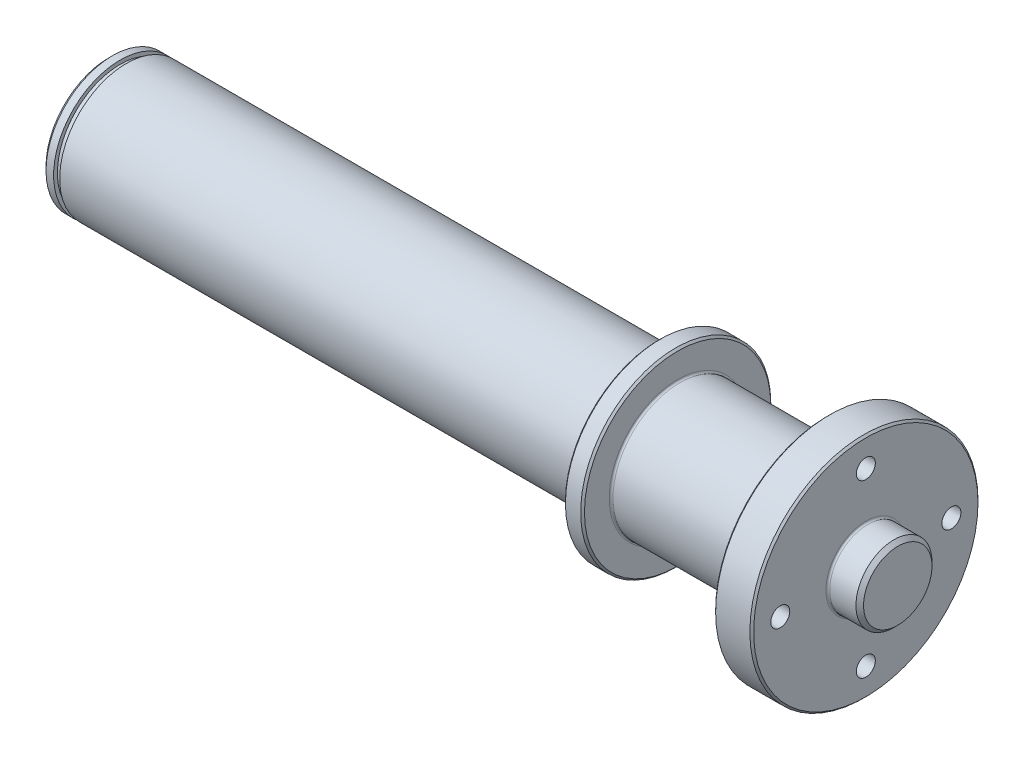
ISO-10303-21;
HEADER;
FILE_DESCRIPTION(('STEP AP214'),'2;1');
FILE_NAME('part.step','',(''),(''),'','','');
FILE_SCHEMA(('AUTOMOTIVE_DESIGN { 1 0 10303 214 1 1 1 1 }'));
ENDSEC;
DATA;
#1=APPLICATION_CONTEXT('core data for automotive mechanical design processes');
#2=APPLICATION_PROTOCOL_DEFINITION('international standard','automotive_design',2000,#1);
#3=PRODUCT_CONTEXT('',#1,'mechanical');
#4=PRODUCT('Part','Part','',(#3));
#5=PRODUCT_RELATED_PRODUCT_CATEGORY('part','',(#4));
#6=PRODUCT_DEFINITION_FORMATION('','',#4);
#7=PRODUCT_DEFINITION_CONTEXT('part definition',#1,'design');
#8=PRODUCT_DEFINITION('design','',#6,#7);
#9=PRODUCT_DEFINITION_SHAPE('','',#8);
#10=(LENGTH_UNIT() NAMED_UNIT(*) SI_UNIT(.MILLI.,.METRE.));
#11=(NAMED_UNIT(*) PLANE_ANGLE_UNIT() SI_UNIT($,.RADIAN.));
#12=(NAMED_UNIT(*) SI_UNIT($,.STERADIAN.) SOLID_ANGLE_UNIT());
#13=UNCERTAINTY_MEASURE_WITH_UNIT(LENGTH_MEASURE(1.E-05),#10,'distance_accuracy_value','');
#14=(GEOMETRIC_REPRESENTATION_CONTEXT(3) GLOBAL_UNCERTAINTY_ASSIGNED_CONTEXT((#13)) GLOBAL_UNIT_ASSIGNED_CONTEXT((#10,
#11,#12)) REPRESENTATION_CONTEXT('',''));
#15=CARTESIAN_POINT('',(0.,0.,0.));
#16=DIRECTION('',(0.,0.,1.));
#17=DIRECTION('',(1.,0.,0.));
#18=AXIS2_PLACEMENT_3D('',#15,#16,#17);
#19=CARTESIAN_POINT('',(0.,0.,0.));
#20=DIRECTION('',(-1.,0.,0.));
#21=DIRECTION('',(0.,0.,1.));
#22=AXIS2_PLACEMENT_3D('',#19,#20,#21);
#23=PLANE('',#22);
#24=CARTESIAN_POINT('',(0.,0.,0.));
#25=DIRECTION('',(-1.,0.,0.));
#26=DIRECTION('',(0.,0.,1.));
#27=AXIS2_PLACEMENT_3D('',#24,#25,#26);
#28=CIRCLE('',#27,16.5);
#29=CARTESIAN_POINT('',(0.,0.,16.5));
#30=VERTEX_POINT('',#29);
#31=EDGE_CURVE('E142',#30,#30,#28,.T.);
#32=ORIENTED_EDGE('',*,*,#31,.T.);
#33=EDGE_LOOP('',(#32));
#34=FACE_BOUND('',#33,.T.);
#35=ADVANCED_FACE('F34',(#34),#23,.T.);
#36=CARTESIAN_POINT('',(0.,0.,0.));
#37=DIRECTION('',(1.,0.,0.));
#38=DIRECTION('',(0.,0.,-1.));
#39=AXIS2_PLACEMENT_3D('',#36,#37,#38);
#40=CYLINDRICAL_SURFACE('',#39,17.5);
#41=CARTESIAN_POINT('',(0.99999999999998,0.,0.));
#42=DIRECTION('',(-1.,0.,0.));
#43=DIRECTION('',(0.,0.,1.));
#44=AXIS2_PLACEMENT_3D('',#41,#42,#43);
#45=CIRCLE('',#44,17.5);
#46=CARTESIAN_POINT('',(0.99999999999998,0.,17.5));
#47=VERTEX_POINT('',#46);
#48=EDGE_CURVE('E139',#47,#47,#45,.F.);
#49=ORIENTED_EDGE('',*,*,#48,.T.);
#50=EDGE_LOOP('',(#49));
#51=FACE_BOUND('',#50,.T.);
#52=CARTESIAN_POINT('',(3.,0.,0.));
#53=DIRECTION('',(1.,0.,0.));
#54=DIRECTION('',(0.,0.,-1.));
#55=AXIS2_PLACEMENT_3D('',#52,#53,#54);
#56=CIRCLE('',#55,17.5);
#57=CARTESIAN_POINT('',(3.,0.,-17.5));
#58=VERTEX_POINT('',#57);
#59=EDGE_CURVE('E136',#58,#58,#56,.T.);
#60=ORIENTED_EDGE('',*,*,#59,.F.);
#61=EDGE_LOOP('',(#60));
#62=FACE_BOUND('',#61,.T.);
#63=ADVANCED_FACE('F250',(#51,#62),#40,.T.);
#64=CARTESIAN_POINT('',(3.,17.5,0.));
#65=DIRECTION('',(1.,0.,0.));
#66=DIRECTION('',(0.,0.,-1.));
#67=AXIS2_PLACEMENT_3D('',#64,#65,#66);
#68=PLANE('',#67);
#69=ORIENTED_EDGE('',*,*,#59,.T.);
#70=EDGE_LOOP('',(#69));
#71=FACE_BOUND('',#70,.T.);
#72=CARTESIAN_POINT('',(3.,0.,0.));
#73=DIRECTION('',(1.,0.,0.));
#74=DIRECTION('',(0.,0.,-1.));
#75=AXIS2_PLACEMENT_3D('',#72,#73,#74);
#76=CIRCLE('',#75,16.5);
#77=CARTESIAN_POINT('',(3.,0.,-16.5));
#78=VERTEX_POINT('',#77);
#79=EDGE_CURVE('E133',#78,#78,#76,.T.);
#80=ORIENTED_EDGE('',*,*,#79,.F.);
#81=EDGE_LOOP('',(#80));
#82=FACE_BOUND('',#81,.T.);
#83=ADVANCED_FACE('F246',(#71,#82),#68,.T.);
#84=CARTESIAN_POINT('',(0.,0.,0.));
#85=DIRECTION('',(1.,0.,0.));
#86=DIRECTION('',(0.,0.,-1.));
#87=AXIS2_PLACEMENT_3D('',#84,#85,#86);
#88=CYLINDRICAL_SURFACE('',#87,16.5);
#89=ORIENTED_EDGE('',*,*,#79,.T.);
#90=EDGE_LOOP('',(#89));
#91=FACE_BOUND('',#90,.T.);
#92=CARTESIAN_POINT('',(4.6,0.,0.));
#93=DIRECTION('',(1.,0.,0.));
#94=DIRECTION('',(0.,0.,-1.));
#95=AXIS2_PLACEMENT_3D('',#92,#93,#94);
#96=CIRCLE('',#95,16.5);
#97=CARTESIAN_POINT('',(4.6,0.,-16.5));
#98=VERTEX_POINT('',#97);
#99=EDGE_CURVE('E130',#98,#98,#96,.T.);
#100=ORIENTED_EDGE('',*,*,#99,.F.);
#101=EDGE_LOOP('',(#100));
#102=FACE_BOUND('',#101,.T.);
#103=ADVANCED_FACE('F241',(#91,#102),#88,.T.);
#104=CARTESIAN_POINT('',(4.6,16.5,0.));
#105=DIRECTION('',(-1.,0.,0.));
#106=DIRECTION('',(0.,0.,1.));
#107=AXIS2_PLACEMENT_3D('',#104,#105,#106);
#108=PLANE('',#107);
#109=ORIENTED_EDGE('',*,*,#99,.T.);
#110=EDGE_LOOP('',(#109));
#111=FACE_BOUND('',#110,.T.);
#112=CARTESIAN_POINT('',(4.6,0.,0.));
#113=DIRECTION('',(1.,0.,0.));
#114=DIRECTION('',(0.,0.,-1.));
#115=AXIS2_PLACEMENT_3D('',#112,#113,#114);
#116=CIRCLE('',#115,17.5);
#117=CARTESIAN_POINT('',(4.6,0.,-17.5));
#118=VERTEX_POINT('',#117);
#119=EDGE_CURVE('E127',#118,#118,#116,.T.);
#120=ORIENTED_EDGE('',*,*,#119,.F.);
#121=EDGE_LOOP('',(#120));
#122=FACE_BOUND('',#121,.T.);
#123=ADVANCED_FACE('F235',(#111,#122),#108,.T.);
#124=CARTESIAN_POINT('',(0.,0.,0.));
#125=DIRECTION('',(1.,0.,0.));
#126=DIRECTION('',(0.,0.,-1.));
#127=AXIS2_PLACEMENT_3D('',#124,#125,#126);
#128=CYLINDRICAL_SURFACE('',#127,17.5);
#129=CARTESIAN_POINT('',(42.1,5.,-16.7705098312484));
#130=CARTESIAN_POINT('',(42.2375437669468,5.00001814544053,-16.7704912725158));
#131=CARTESIAN_POINT('',(42.3750806220229,4.99432529208164,-16.7722013219269));
#132=CARTESIAN_POINT('',(42.6491111892844,4.97165222541633,-16.7789431019967));
#133=CARTESIAN_POINT('',(42.7856051118428,4.95467435267922,-16.7839741438635));
#134=CARTESIAN_POINT('',(43.0562584540195,4.90961903685605,-16.7972068372471));
#135=CARTESIAN_POINT('',(43.1904226248333,4.88156789644729,-16.8054009743523));
#136=CARTESIAN_POINT('',(43.4557996419888,4.81461674604718,-16.8247046364186));
#137=CARTESIAN_POINT('',(43.587012422422,4.77571649404058,-16.8358142264156));
#138=CARTESIAN_POINT('',(43.8455316606223,4.68740449021953,-16.8606149796878));
#139=CARTESIAN_POINT('',(43.972840055364,4.63799805032664,-16.874304837985));
#140=CARTESIAN_POINT('',(44.2227993627257,4.52905522001708,-16.9038705765848));
#141=CARTESIAN_POINT('',(44.3454485233715,4.46951506432954,-16.9197472690052));
#142=CARTESIAN_POINT('',(44.705208360307,4.27631278448764,-16.9699997678901));
#143=CARTESIAN_POINT('',(44.9342983618955,4.12801150136261,-17.007014905076));
#144=CARTESIAN_POINT('',(45.3705139648694,3.7922991578269,-17.0850471293107));
#145=CARTESIAN_POINT('',(45.576920274657,3.60397767000143,-17.1261428352533));
#146=CARTESIAN_POINT('',(45.9557376930736,3.19544341696382,-17.2070462516998));
#147=CARTESIAN_POINT('',(46.128143164041,2.97522537348191,-17.2468537476932));
#148=CARTESIAN_POINT('',(46.4370780919675,2.5041085165938,-17.3215844019063));
#149=CARTESIAN_POINT('',(46.5728809242985,2.25271539483174,-17.3564029869975));
#150=CARTESIAN_POINT('',(46.8000077123923,1.72950937060037,-17.4163145657263));
#151=CARTESIAN_POINT('',(46.8913423051881,1.45770136944961,-17.4414098849257));
#152=CARTESIAN_POINT('',(47.0245857008507,0.908899275051303,-17.4784878135792));
#153=CARTESIAN_POINT('',(47.0677218545897,0.632225504452071,-17.4907954521753));
#154=CARTESIAN_POINT('',(47.1072166941546,0.0753060921048352,-17.5020523750682));
#155=CARTESIAN_POINT('',(47.1035833309957,-0.204938934421977,-17.5010039299558));
#156=CARTESIAN_POINT('',(47.0504845198055,-0.752451373530216,-17.4859002467781));
#157=CARTESIAN_POINT('',(47.0023476007258,-1.0198597093415,-17.4722220494947));
#158=CARTESIAN_POINT('',(46.8637591704515,-1.54263514692821,-17.433846479088));
#159=CARTESIAN_POINT('',(46.7733055229895,-1.79800164008105,-17.4091485496606));
#160=CARTESIAN_POINT('',(46.5517336287344,-2.29267928834747,-17.3509771517082));
#161=CARTESIAN_POINT('',(46.4201810479175,-2.53178407311227,-17.3174105731756));
#162=CARTESIAN_POINT('',(46.1203556664245,-2.98504901208546,-17.2450626129451));
#163=CARTESIAN_POINT('',(45.9520754127235,-3.19920408978386,-17.2062801734237));
#164=CARTESIAN_POINT('',(45.6723726411755,-3.50113424709605,-17.1465202223136));
#165=CARTESIAN_POINT('',(45.5726361356536,-3.6000742374355,-17.1259700648702));
#166=CARTESIAN_POINT('',(45.3651797576601,-3.78923134613091,-17.0851123940087));
#167=CARTESIAN_POINT('',(45.2574626601299,-3.87945147156873,-17.0648047990745));
#168=CARTESIAN_POINT('',(45.0346549590068,-4.05062437518906,-17.0249868857383));
#169=CARTESIAN_POINT('',(44.9195594701279,-4.13157091233147,-17.005477109874));
#170=CARTESIAN_POINT('',(44.682839206299,-4.28353981460234,-16.9678346429649));
#171=CARTESIAN_POINT('',(44.5612169966662,-4.35456603991597,-16.9497014175386));
#172=CARTESIAN_POINT('',(44.3110840486817,-4.48679157824972,-16.9151829895462));
#173=CARTESIAN_POINT('',(44.1825213722029,-4.54789718496759,-16.898814896638));
#174=CARTESIAN_POINT('',(43.92045850364,-4.65898872141544,-16.8685251216221));
#175=CARTESIAN_POINT('',(43.7869603422387,-4.70897916633161,-16.8546024466245));
#176=CARTESIAN_POINT('',(43.5160789886437,-4.79739484975373,-16.829649854127));
#177=CARTESIAN_POINT('',(43.3787000207409,-4.835832170633,-16.8186169160755));
#178=CARTESIAN_POINT('',(43.1010044543476,-4.90084834749728,-16.7997865631929));
#179=CARTESIAN_POINT('',(42.9606892484807,-4.92743269748004,-16.7919876494693));
#180=CARTESIAN_POINT('',(42.7003348857874,-4.96528740578586,-16.7808301521248));
#181=CARTESIAN_POINT('',(42.5805683702716,-4.97830600651657,-16.776966894118));
#182=CARTESIAN_POINT('',(42.3405377051843,-4.99566040544727,-16.7718034889731));
#183=CARTESIAN_POINT('',(42.220274596223,-5.0000094465416,-16.7704994326599));
#184=CARTESIAN_POINT('',(42.1,-4.99999999999999,-16.7705098312484));
#185=B_SPLINE_CURVE_WITH_KNOTS('',3,(#129,#130,#131,#132,#133,#134,#135,#136,#137,#138,#139,
#140,#141,#142,#143,#144,#145,#146,#147,#148,#149,#150,#151,#152,#153,#154,#155,#156,#157,#158,
#159,#160,#161,#162,#163,#164,#165,#166,#167,#168,#169,#170,#171,#172,#173,#174,#175,#176,#177,
#178,#179,#180,#181,#182,#183,#184),.UNSPECIFIED.,.F.,.F.,(4,2,2,2,2,2,2,2,2,2,2,2,2,2,2,2,2,2,
2,2,2,2,2,2,2,2,2,4),(0.,0.412492178804547,0.824898831357982,1.23633171981251,1.64777378699039,
2.05900832185038,2.47039598941262,3.29264569343991,4.13611232627188,4.9797186965021,
5.83900986868947,6.69809539287325,7.53476732988531,8.37129703101929,9.18363381655587,
9.99601161556283,10.8172828992968,11.6387209961027,12.0642579015972,12.489647531354,
12.9153217832843,13.3408299328975,13.7701489130554,14.1992931759112,14.6279870611799,
15.056482034464,15.4177510461265,15.7784677892952),.UNSPECIFIED.);
#186=CARTESIAN_POINT('',(42.1,5.,-16.7705098312484));
#187=VERTEX_POINT('',#186);
#188=CARTESIAN_POINT('',(42.1,-5.,-16.7705098312484));
#189=VERTEX_POINT('',#188);
#190=EDGE_CURVE('E199',#187,#189,#185,.T.);
#191=ORIENTED_EDGE('',*,*,#190,.F.);
#192=DIRECTION('',(1.,0.,0.));
#193=VECTOR('',#192,1.);
#194=CARTESIAN_POINT('',(0.,5.,-16.7705098312484));
#195=LINE('',#194,#193);
#196=CARTESIAN_POINT('',(12.1,5.,-16.7705098312484));
#197=VERTEX_POINT('',#196);
#198=EDGE_CURVE('E11',#197,#187,#195,.T.);
#199=ORIENTED_EDGE('',*,*,#198,.F.);
#200=CARTESIAN_POINT('',(12.1,-5.,-16.7705098312484));
#201=CARTESIAN_POINT('',(11.9624562330531,-5.00001814544053,-16.7704912725158));
#202=CARTESIAN_POINT('',(11.8249193779771,-4.99432529208164,-16.7722013219269));
#203=CARTESIAN_POINT('',(11.5508888107156,-4.97165222541634,-16.7789431019967));
#204=CARTESIAN_POINT('',(11.4143948881572,-4.95467435267923,-16.7839741438635));
#205=CARTESIAN_POINT('',(11.1437415459805,-4.90961903685605,-16.7972068372471));
#206=CARTESIAN_POINT('',(11.0095773751667,-4.88156789644729,-16.8054009743523));
#207=CARTESIAN_POINT('',(10.7442003580112,-4.81461674604718,-16.8247046364186));
#208=CARTESIAN_POINT('',(10.612987577578,-4.77571649404059,-16.8358142264156));
#209=CARTESIAN_POINT('',(10.3544683393777,-4.68740449021953,-16.8606149796878));
#210=CARTESIAN_POINT('',(10.227159944636,-4.63799805032664,-16.874304837985));
#211=CARTESIAN_POINT('',(9.97720063727428,-4.52905522001708,-16.9038705765848));
#212=CARTESIAN_POINT('',(9.85455147662851,-4.46951506432954,-16.9197472690052));
#213=CARTESIAN_POINT('',(9.49479163969302,-4.27631278448765,-16.9699997678901));
#214=CARTESIAN_POINT('',(9.26570163810453,-4.12801150136261,-17.007014905076));
#215=CARTESIAN_POINT('',(8.82948603513064,-3.79229915782691,-17.0850471293107));
#216=CARTESIAN_POINT('',(8.62307972534301,-3.60397767000144,-17.1261428352533));
#217=CARTESIAN_POINT('',(8.24426230692643,-3.19544341696382,-17.2070462516998));
#218=CARTESIAN_POINT('',(8.07185683595896,-2.97522537348192,-17.2468537476932));
#219=CARTESIAN_POINT('',(7.76292190803247,-2.5041085165938,-17.3215844019063));
#220=CARTESIAN_POINT('',(7.62711907570154,-2.25271539483174,-17.3564029869975));
#221=CARTESIAN_POINT('',(7.39999228760769,-1.72950937060037,-17.4163145657263));
#222=CARTESIAN_POINT('',(7.3086576948119,-1.45770136944961,-17.4414098849257));
#223=CARTESIAN_POINT('',(7.17541429914927,-0.908899275051308,-17.4784878135792));
#224=CARTESIAN_POINT('',(7.13227814541032,-0.632225504452075,-17.4907954521753));
#225=CARTESIAN_POINT('',(7.09278330584538,-0.0753060921048372,-17.5020523750682));
#226=CARTESIAN_POINT('',(7.09641666900433,0.204938934421976,-17.5010039299558));
#227=CARTESIAN_POINT('',(7.14951548019445,0.752451373530216,-17.4859002467781));
#228=CARTESIAN_POINT('',(7.19765239927417,1.0198597093415,-17.4722220494947));
#229=CARTESIAN_POINT('',(7.33624082954846,1.54263514692821,-17.433846479088));
#230=CARTESIAN_POINT('',(7.42669447701044,1.79800164008106,-17.4091485496606));
#231=CARTESIAN_POINT('',(7.64826637126563,2.29267928834747,-17.3509771517082));
#232=CARTESIAN_POINT('',(7.7798189520825,2.53178407311227,-17.3174105731756));
#233=CARTESIAN_POINT('',(8.07964433357547,2.98504901208546,-17.2450626129451));
#234=CARTESIAN_POINT('',(8.24792458727652,3.19920408978386,-17.2062801734237));
#235=CARTESIAN_POINT('',(8.52762735882451,3.50113424709606,-17.1465202223136));
#236=CARTESIAN_POINT('',(8.62736386434642,3.60007423743551,-17.1259700648702));
#237=CARTESIAN_POINT('',(8.83482024233988,3.78923134613091,-17.0851123940087));
#238=CARTESIAN_POINT('',(8.94253733987009,3.87945147156873,-17.0648047990745));
#239=CARTESIAN_POINT('',(9.16534504099315,4.05062437518906,-17.0249868857383));
#240=CARTESIAN_POINT('',(9.28044052987208,4.13157091233148,-17.005477109874));
#241=CARTESIAN_POINT('',(9.51716079370096,4.28353981460235,-16.9678346429649));
#242=CARTESIAN_POINT('',(9.63878300333382,4.35456603991598,-16.9497014175386));
#243=CARTESIAN_POINT('',(9.88891595131824,4.48679157824972,-16.9151829895461));
#244=CARTESIAN_POINT('',(10.0174786277971,4.5478971849676,-16.898814896638));
#245=CARTESIAN_POINT('',(10.27954149636,4.65898872141545,-16.8685251216221));
#246=CARTESIAN_POINT('',(10.4130396577612,4.70897916633163,-16.8546024466245));
#247=CARTESIAN_POINT('',(10.6839210113563,4.79739484975374,-16.829649854127));
#248=CARTESIAN_POINT('',(10.8212999792591,4.83583217063301,-16.8186169160755));
#249=CARTESIAN_POINT('',(11.0989955456524,4.90084834749729,-16.7997865631929));
#250=CARTESIAN_POINT('',(11.2393107515193,4.92743269748005,-16.7919876494693));
#251=CARTESIAN_POINT('',(11.4996651142126,4.96528740578587,-16.7808301521248));
#252=CARTESIAN_POINT('',(11.6194316297284,4.97830600651658,-16.776966894118));
#253=CARTESIAN_POINT('',(11.8594622948157,4.99566040544728,-16.7718034889731));
#254=CARTESIAN_POINT('',(11.979725403777,5.00000944654161,-16.7704994326599));
#255=CARTESIAN_POINT('',(12.1,5.,-16.7705098312484));
#256=B_SPLINE_CURVE_WITH_KNOTS('',3,(#200,#201,#202,#203,#204,#205,#206,#207,#208,#209,#210,
#211,#212,#213,#214,#215,#216,#217,#218,#219,#220,#221,#222,#223,#224,#225,#226,#227,#228,#229,
#230,#231,#232,#233,#234,#235,#236,#237,#238,#239,#240,#241,#242,#243,#244,#245,#246,#247,#248,
#249,#250,#251,#252,#253,#254,#255),.UNSPECIFIED.,.F.,.F.,(4,2,2,2,2,2,2,2,2,2,2,2,2,2,2,2,2,2,
2,2,2,2,2,2,2,2,2,4),(0.,0.412492178804547,0.82489883135798,1.23633171981252,1.64777378699039,
2.05900832185038,2.47039598941263,3.29264569343992,4.13611232627188,4.9797186965021,
5.83900986868947,6.69809539287325,7.53476732988532,8.3712970310193,9.18363381655588,
9.99601161556285,10.8172828992968,11.6387209961027,12.0642579015972,12.489647531354,
12.9153217832844,13.3408299328975,13.7701489130555,14.1992931759112,14.6279870611799,
15.056482034464,15.4177510461265,15.7784677892953),.UNSPECIFIED.);
#257=CARTESIAN_POINT('',(12.1,-5.,-16.7705098312484));
#258=VERTEX_POINT('',#257);
#259=EDGE_CURVE('E42',#258,#197,#256,.T.);
#260=ORIENTED_EDGE('',*,*,#259,.F.);
#261=DIRECTION('',(1.,0.,0.));
#262=VECTOR('',#261,1.);
#263=CARTESIAN_POINT('',(0.,-5.,-16.7705098312484));
#264=LINE('',#263,#262);
#265=EDGE_CURVE('E207',#189,#258,#264,.F.);
#266=ORIENTED_EDGE('',*,*,#265,.F.);
#267=EDGE_LOOP('',(#191,#199,#260,#266));
#268=FACE_BOUND('',#267,.T.);
#269=CARTESIAN_POINT('',(144.1,0.,0.));
#270=DIRECTION('',(-1.,0.,0.));
#271=DIRECTION('',(0.,0.,1.));
#272=AXIS2_PLACEMENT_3D('',#269,#270,#271);
#273=CIRCLE('',#272,17.5);
#274=CARTESIAN_POINT('',(144.1,0.,17.5));
#275=VERTEX_POINT('',#274);
#276=EDGE_CURVE('E163',#275,#275,#273,.T.);
#277=ORIENTED_EDGE('',*,*,#276,.T.);
#278=EDGE_LOOP('',(#277));
#279=FACE_BOUND('',#278,.T.);
#280=ORIENTED_EDGE('',*,*,#119,.T.);
#281=EDGE_LOOP('',(#280));
#282=FACE_BOUND('',#281,.T.);
#283=ADVANCED_FACE('F208',(#268,#279,#282),#128,.T.);
#284=CARTESIAN_POINT('',(144.6,17.5,0.));
#285=DIRECTION('',(-1.,0.,0.));
#286=DIRECTION('',(0.,0.,1.));
#287=AXIS2_PLACEMENT_3D('',#284,#285,#286);
#288=PLANE('',#287);
#289=CARTESIAN_POINT('',(144.6,0.,0.));
#290=DIRECTION('',(-1.,0.,0.));
#291=DIRECTION('',(0.,0.,1.));
#292=AXIS2_PLACEMENT_3D('',#289,#290,#291);
#293=CIRCLE('',#292,24.5);
#294=CARTESIAN_POINT('',(144.6,0.,24.5));
#295=VERTEX_POINT('',#294);
#296=EDGE_CURVE('E190',#295,#295,#293,.T.);
#297=ORIENTED_EDGE('',*,*,#296,.T.);
#298=EDGE_LOOP('',(#297));
#299=FACE_BOUND('',#298,.T.);
#300=CARTESIAN_POINT('',(144.6,0.,0.));
#301=DIRECTION('',(-1.,0.,0.));
#302=DIRECTION('',(0.,0.,1.));
#303=AXIS2_PLACEMENT_3D('',#300,#301,#302);
#304=CIRCLE('',#303,18.);
#305=CARTESIAN_POINT('',(144.6,0.,18.));
#306=VERTEX_POINT('',#305);
#307=EDGE_CURVE('E160',#306,#306,#304,.F.);
#308=ORIENTED_EDGE('',*,*,#307,.T.);
#309=EDGE_LOOP('',(#308));
#310=FACE_BOUND('',#309,.T.);
#311=ADVANCED_FACE('F234',(#299,#310),#288,.T.);
#312=CARTESIAN_POINT('',(0.,0.,0.));
#313=DIRECTION('',(1.,0.,0.));
#314=DIRECTION('',(0.,0.,-1.));
#315=AXIS2_PLACEMENT_3D('',#312,#313,#314);
#316=CYLINDRICAL_SURFACE('',#315,25.);
#317=CARTESIAN_POINT('',(149.1,0.,0.));
#318=DIRECTION('',(1.,0.,0.));
#319=DIRECTION('',(0.,0.,-1.));
#320=AXIS2_PLACEMENT_3D('',#317,#318,#319);
#321=CIRCLE('',#320,25.);
#322=CARTESIAN_POINT('',(149.1,0.,-25.));
#323=VERTEX_POINT('',#322);
#324=EDGE_CURVE('E187',#323,#323,#321,.F.);
#325=ORIENTED_EDGE('',*,*,#324,.T.);
#326=EDGE_LOOP('',(#325));
#327=FACE_BOUND('',#326,.T.);
#328=CARTESIAN_POINT('',(145.1,0.,0.));
#329=DIRECTION('',(-1.,0.,0.));
#330=DIRECTION('',(0.,0.,1.));
#331=AXIS2_PLACEMENT_3D('',#328,#329,#330);
#332=CIRCLE('',#331,25.);
#333=CARTESIAN_POINT('',(145.1,0.,25.));
#334=VERTEX_POINT('',#333);
#335=EDGE_CURVE('E184',#334,#334,#332,.F.);
#336=ORIENTED_EDGE('',*,*,#335,.T.);
#337=EDGE_LOOP('',(#336));
#338=FACE_BOUND('',#337,.T.);
#339=ADVANCED_FACE('F302',(#327,#338),#316,.T.);
#340=CARTESIAN_POINT('',(149.6,25.,0.));
#341=DIRECTION('',(1.,0.,0.));
#342=DIRECTION('',(0.,0.,-1.));
#343=AXIS2_PLACEMENT_3D('',#340,#341,#342);
#344=PLANE('',#343);
#345=CARTESIAN_POINT('',(149.6,0.,0.));
#346=DIRECTION('',(1.,0.,0.));
#347=DIRECTION('',(0.,0.,-1.));
#348=AXIS2_PLACEMENT_3D('',#345,#346,#347);
#349=CIRCLE('',#348,24.5);
#350=CARTESIAN_POINT('',(149.6,0.,-24.5));
#351=VERTEX_POINT('',#350);
#352=EDGE_CURVE('E181',#351,#351,#349,.T.);
#353=ORIENTED_EDGE('',*,*,#352,.T.);
#354=EDGE_LOOP('',(#353));
#355=FACE_BOUND('',#354,.T.);
#356=CARTESIAN_POINT('',(149.6,0.,0.));
#357=DIRECTION('',(1.,0.,0.));
#358=DIRECTION('',(0.,0.,-1.));
#359=AXIS2_PLACEMENT_3D('',#356,#357,#358);
#360=CIRCLE('',#359,18.);
#361=CARTESIAN_POINT('',(149.6,0.,-18.));
#362=VERTEX_POINT('',#361);
#363=EDGE_CURVE('E166',#362,#362,#360,.F.);
#364=ORIENTED_EDGE('',*,*,#363,.T.);
#365=EDGE_LOOP('',(#364));
#366=FACE_BOUND('',#365,.T.);
#367=ADVANCED_FACE('F304',(#355,#366),#344,.T.);
#368=CARTESIAN_POINT('',(0.,0.,0.));
#369=DIRECTION('',(1.,0.,0.));
#370=DIRECTION('',(0.,0.,-1.));
#371=AXIS2_PLACEMENT_3D('',#368,#369,#370);
#372=CYLINDRICAL_SURFACE('',#371,17.5);
#373=CARTESIAN_POINT('',(188.6,0.,0.));
#374=DIRECTION('',(-1.,0.,0.));
#375=DIRECTION('',(0.,0.,1.));
#376=AXIS2_PLACEMENT_3D('',#373,#374,#375);
#377=CIRCLE('',#376,17.5);
#378=CARTESIAN_POINT('',(188.6,0.,17.5));
#379=VERTEX_POINT('',#378);
#380=EDGE_CURVE('E157',#379,#379,#377,.T.);
#381=ORIENTED_EDGE('',*,*,#380,.T.);
#382=EDGE_LOOP('',(#381));
#383=FACE_BOUND('',#382,.T.);
#384=CARTESIAN_POINT('',(150.1,0.,0.));
#385=DIRECTION('',(1.,0.,0.));
#386=DIRECTION('',(0.,0.,-1.));
#387=AXIS2_PLACEMENT_3D('',#384,#385,#386);
#388=CIRCLE('',#387,17.5);
#389=CARTESIAN_POINT('',(150.1,0.,-17.5));
#390=VERTEX_POINT('',#389);
#391=EDGE_CURVE('E154',#390,#390,#388,.T.);
#392=ORIENTED_EDGE('',*,*,#391,.T.);
#393=EDGE_LOOP('',(#392));
#394=FACE_BOUND('',#393,.T.);
#395=ADVANCED_FACE('F311',(#383,#394),#372,.T.);
#396=CARTESIAN_POINT('',(189.1,17.5,0.));
#397=DIRECTION('',(-1.,0.,0.));
#398=DIRECTION('',(0.,0.,1.));
#399=AXIS2_PLACEMENT_3D('',#396,#397,#398);
#400=PLANE('',#399);
#401=CARTESIAN_POINT('',(189.1,0.,0.));
#402=DIRECTION('',(-1.,0.,0.));
#403=DIRECTION('',(0.,0.,1.));
#404=AXIS2_PLACEMENT_3D('',#401,#402,#403);
#405=CIRCLE('',#404,29.5);
#406=CARTESIAN_POINT('',(189.1,0.,29.5));
#407=VERTEX_POINT('',#406);
#408=EDGE_CURVE('E178',#407,#407,#405,.T.);
#409=ORIENTED_EDGE('',*,*,#408,.T.);
#410=EDGE_LOOP('',(#409));
#411=FACE_BOUND('',#410,.T.);
#412=CARTESIAN_POINT('',(189.1,0.,0.));
#413=DIRECTION('',(-1.,0.,0.));
#414=DIRECTION('',(0.,0.,1.));
#415=AXIS2_PLACEMENT_3D('',#412,#413,#414);
#416=CIRCLE('',#415,18.);
#417=CARTESIAN_POINT('',(189.1,0.,18.));
#418=VERTEX_POINT('',#417);
#419=EDGE_CURVE('E151',#418,#418,#416,.F.);
#420=ORIENTED_EDGE('',*,*,#419,.T.);
#421=EDGE_LOOP('',(#420));
#422=FACE_BOUND('',#421,.T.);
#423=CARTESIAN_POINT('',(189.1,22.5,0.));
#424=DIRECTION('',(-1.,0.,0.));
#425=DIRECTION('',(0.,0.,1.));
#426=AXIS2_PLACEMENT_3D('',#423,#424,#425);
#427=CIRCLE('',#426,2.49999999999999);
#428=CARTESIAN_POINT('',(189.1,22.5,2.49999999999999));
#429=VERTEX_POINT('',#428);
#430=EDGE_CURVE('E106',#429,#429,#427,.T.);
#431=ORIENTED_EDGE('',*,*,#430,.F.);
#432=EDGE_LOOP('',(#431));
#433=FACE_BOUND('',#432,.T.);
#434=CARTESIAN_POINT('',(189.1,0.,-22.5));
#435=DIRECTION('',(-1.,0.,0.));
#436=DIRECTION('',(0.,0.,1.));
#437=AXIS2_PLACEMENT_3D('',#434,#435,#436);
#438=CIRCLE('',#437,2.49999999999999);
#439=CARTESIAN_POINT('',(189.1,0.,-20.));
#440=VERTEX_POINT('',#439);
#441=EDGE_CURVE('E112',#440,#440,#438,.T.);
#442=ORIENTED_EDGE('',*,*,#441,.F.);
#443=EDGE_LOOP('',(#442));
#444=FACE_BOUND('',#443,.T.);
#445=CARTESIAN_POINT('',(189.1,-22.5,0.));
#446=DIRECTION('',(-1.,0.,0.));
#447=DIRECTION('',(0.,0.,1.));
#448=AXIS2_PLACEMENT_3D('',#445,#446,#447);
#449=CIRCLE('',#448,2.49999999999999);
#450=CARTESIAN_POINT('',(189.1,-22.5,2.49999999999999));
#451=VERTEX_POINT('',#450);
#452=EDGE_CURVE('E118',#451,#451,#449,.T.);
#453=ORIENTED_EDGE('',*,*,#452,.F.);
#454=EDGE_LOOP('',(#453));
#455=FACE_BOUND('',#454,.T.);
#456=CARTESIAN_POINT('',(189.1,0.,22.5));
#457=DIRECTION('',(-1.,0.,0.));
#458=DIRECTION('',(0.,0.,1.));
#459=AXIS2_PLACEMENT_3D('',#456,#457,#458);
#460=CIRCLE('',#459,2.49999999999999);
#461=CARTESIAN_POINT('',(189.1,0.,25.));
#462=VERTEX_POINT('',#461);
#463=EDGE_CURVE('E124',#462,#462,#460,.T.);
#464=ORIENTED_EDGE('',*,*,#463,.F.);
#465=EDGE_LOOP('',(#464));
#466=FACE_BOUND('',#465,.T.);
#467=ADVANCED_FACE('F318',(#411,#422,#433,#444,#455,#466),#400,.T.);
#468=CARTESIAN_POINT('',(0.,0.,0.));
#469=DIRECTION('',(1.,0.,0.));
#470=DIRECTION('',(0.,0.,-1.));
#471=AXIS2_PLACEMENT_3D('',#468,#469,#470);
#472=CYLINDRICAL_SURFACE('',#471,30.);
#473=CARTESIAN_POINT('',(198.6,0.,0.));
#474=DIRECTION('',(1.,0.,0.));
#475=DIRECTION('',(0.,0.,-1.));
#476=AXIS2_PLACEMENT_3D('',#473,#474,#475);
#477=CIRCLE('',#476,30.);
#478=CARTESIAN_POINT('',(198.6,0.,-30.));
#479=VERTEX_POINT('',#478);
#480=EDGE_CURVE('E175',#479,#479,#477,.F.);
#481=ORIENTED_EDGE('',*,*,#480,.T.);
#482=EDGE_LOOP('',(#481));
#483=FACE_BOUND('',#482,.T.);
#484=CARTESIAN_POINT('',(189.6,0.,0.));
#485=DIRECTION('',(-1.,0.,0.));
#486=DIRECTION('',(0.,0.,1.));
#487=AXIS2_PLACEMENT_3D('',#484,#485,#486);
#488=CIRCLE('',#487,30.);
#489=CARTESIAN_POINT('',(189.6,0.,30.));
#490=VERTEX_POINT('',#489);
#491=EDGE_CURVE('E172',#490,#490,#488,.F.);
#492=ORIENTED_EDGE('',*,*,#491,.T.);
#493=EDGE_LOOP('',(#492));
#494=FACE_BOUND('',#493,.T.);
#495=ADVANCED_FACE('F322',(#483,#494),#472,.T.);
#496=CARTESIAN_POINT('',(199.1,30.,0.));
#497=DIRECTION('',(1.,0.,0.));
#498=DIRECTION('',(0.,0.,-1.));
#499=AXIS2_PLACEMENT_3D('',#496,#497,#498);
#500=PLANE('',#499);
#501=CARTESIAN_POINT('',(199.1,0.,0.));
#502=DIRECTION('',(1.,0.,0.));
#503=DIRECTION('',(0.,0.,-1.));
#504=AXIS2_PLACEMENT_3D('',#501,#502,#503);
#505=CIRCLE('',#504,10.5);
#506=CARTESIAN_POINT('',(199.1,0.,-10.5));
#507=VERTEX_POINT('',#506);
#508=EDGE_CURVE('E196',#507,#507,#505,.F.);
#509=ORIENTED_EDGE('',*,*,#508,.T.);
#510=EDGE_LOOP('',(#509));
#511=FACE_BOUND('',#510,.T.);
#512=CARTESIAN_POINT('',(199.1,0.,0.));
#513=DIRECTION('',(1.,0.,0.));
#514=DIRECTION('',(0.,0.,-1.));
#515=AXIS2_PLACEMENT_3D('',#512,#513,#514);
#516=CIRCLE('',#515,29.5);
#517=CARTESIAN_POINT('',(199.1,0.,-29.5));
#518=VERTEX_POINT('',#517);
#519=EDGE_CURVE('E169',#518,#518,#516,.T.);
#520=ORIENTED_EDGE('',*,*,#519,.T.);
#521=EDGE_LOOP('',(#520));
#522=FACE_BOUND('',#521,.T.);
#523=CARTESIAN_POINT('',(199.1,22.5,0.));
#524=DIRECTION('',(1.,0.,0.));
#525=DIRECTION('',(0.,0.,-1.));
#526=AXIS2_PLACEMENT_3D('',#523,#524,#525);
#527=CIRCLE('',#526,2.49999999999999);
#528=CARTESIAN_POINT('',(199.1,22.5,-2.49999999999999));
#529=VERTEX_POINT('',#528);
#530=EDGE_CURVE('E99',#529,#529,#527,.T.);
#531=ORIENTED_EDGE('',*,*,#530,.F.);
#532=EDGE_LOOP('',(#531));
#533=FACE_BOUND('',#532,.T.);
#534=CARTESIAN_POINT('',(199.1,0.,-22.5));
#535=DIRECTION('',(1.,0.,0.));
#536=DIRECTION('',(0.,0.,-1.));
#537=AXIS2_PLACEMENT_3D('',#534,#535,#536);
#538=CIRCLE('',#537,2.49999999999999);
#539=CARTESIAN_POINT('',(199.1,0.,-25.));
#540=VERTEX_POINT('',#539);
#541=EDGE_CURVE('E109',#540,#540,#538,.T.);
#542=ORIENTED_EDGE('',*,*,#541,.F.);
#543=EDGE_LOOP('',(#542));
#544=FACE_BOUND('',#543,.T.);
#545=CARTESIAN_POINT('',(199.1,-22.5,0.));
#546=DIRECTION('',(1.,0.,0.));
#547=DIRECTION('',(0.,0.,-1.));
#548=AXIS2_PLACEMENT_3D('',#545,#546,#547);
#549=CIRCLE('',#548,2.49999999999999);
#550=CARTESIAN_POINT('',(199.1,-22.5,-2.49999999999999));
#551=VERTEX_POINT('',#550);
#552=EDGE_CURVE('E115',#551,#551,#549,.T.);
#553=ORIENTED_EDGE('',*,*,#552,.F.);
#554=EDGE_LOOP('',(#553));
#555=FACE_BOUND('',#554,.T.);
#556=CARTESIAN_POINT('',(199.1,0.,22.5));
#557=DIRECTION('',(1.,0.,0.));
#558=DIRECTION('',(0.,0.,-1.));
#559=AXIS2_PLACEMENT_3D('',#556,#557,#558);
#560=CIRCLE('',#559,2.49999999999999);
#561=CARTESIAN_POINT('',(199.1,0.,20.));
#562=VERTEX_POINT('',#561);
#563=EDGE_CURVE('E121',#562,#562,#560,.T.);
#564=ORIENTED_EDGE('',*,*,#563,.F.);
#565=EDGE_LOOP('',(#564));
#566=FACE_BOUND('',#565,.T.);
#567=ADVANCED_FACE('F326',(#511,#522,#533,#544,#555,#566),#500,.T.);
#568=CARTESIAN_POINT('',(0.,0.,0.));
#569=DIRECTION('',(1.,0.,0.));
#570=DIRECTION('',(0.,0.,-1.));
#571=AXIS2_PLACEMENT_3D('',#568,#569,#570);
#572=CYLINDRICAL_SURFACE('',#571,10.);
#573=CARTESIAN_POINT('',(199.6,0.,0.));
#574=DIRECTION('',(1.,0.,0.));
#575=DIRECTION('',(0.,0.,-1.));
#576=AXIS2_PLACEMENT_3D('',#573,#574,#575);
#577=CIRCLE('',#576,10.);
#578=CARTESIAN_POINT('',(199.6,0.,-10.));
#579=VERTEX_POINT('',#578);
#580=EDGE_CURVE('E193',#579,#579,#577,.T.);
#581=ORIENTED_EDGE('',*,*,#580,.T.);
#582=EDGE_LOOP('',(#581));
#583=FACE_BOUND('',#582,.T.);
#584=CARTESIAN_POINT('',(206.5,0.,0.));
#585=DIRECTION('',(1.,0.,0.));
#586=DIRECTION('',(0.,0.,-1.));
#587=AXIS2_PLACEMENT_3D('',#584,#585,#586);
#588=CIRCLE('',#587,10.);
#589=CARTESIAN_POINT('',(206.5,0.,-10.));
#590=VERTEX_POINT('',#589);
#591=EDGE_CURVE('E148',#590,#590,#588,.F.);
#592=ORIENTED_EDGE('',*,*,#591,.T.);
#593=EDGE_LOOP('',(#592));
#594=FACE_BOUND('',#593,.T.);
#595=ADVANCED_FACE('F330',(#583,#594),#572,.T.);
#596=CARTESIAN_POINT('',(207.5,10.,0.));
#597=DIRECTION('',(1.,0.,0.));
#598=DIRECTION('',(0.,0.,-1.));
#599=AXIS2_PLACEMENT_3D('',#596,#597,#598);
#600=PLANE('',#599);
#601=CARTESIAN_POINT('',(207.5,0.,0.));
#602=DIRECTION('',(1.,0.,0.));
#603=DIRECTION('',(0.,0.,-1.));
#604=AXIS2_PLACEMENT_3D('',#601,#602,#603);
#605=CIRCLE('',#604,9.00000000000004);
#606=CARTESIAN_POINT('',(207.5,0.,-9.00000000000004));
#607=VERTEX_POINT('',#606);
#608=EDGE_CURVE('E145',#607,#607,#605,.T.);
#609=ORIENTED_EDGE('',*,*,#608,.T.);
#610=EDGE_LOOP('',(#609));
#611=FACE_BOUND('',#610,.T.);
#612=ADVANCED_FACE('F334',(#611),#600,.T.);
#613=CARTESIAN_POINT('',(199.1,0.,22.5));
#614=DIRECTION('',(1.,0.,0.));
#615=DIRECTION('',(0.,0.,-1.));
#616=AXIS2_PLACEMENT_3D('',#613,#614,#615);
#617=CYLINDRICAL_SURFACE('',#616,2.49999999999999);
#618=ORIENTED_EDGE('',*,*,#563,.T.);
#619=EDGE_LOOP('',(#618));
#620=FACE_BOUND('',#619,.T.);
#621=ORIENTED_EDGE('',*,*,#463,.T.);
#622=EDGE_LOOP('',(#621));
#623=FACE_BOUND('',#622,.T.);
#624=ADVANCED_FACE('F338',(#620,#623),#617,.F.);
#625=CARTESIAN_POINT('',(199.1,-22.5,0.));
#626=DIRECTION('',(1.,0.,0.));
#627=DIRECTION('',(0.,0.,-1.));
#628=AXIS2_PLACEMENT_3D('',#625,#626,#627);
#629=CYLINDRICAL_SURFACE('',#628,2.49999999999999);
#630=ORIENTED_EDGE('',*,*,#552,.T.);
#631=EDGE_LOOP('',(#630));
#632=FACE_BOUND('',#631,.T.);
#633=ORIENTED_EDGE('',*,*,#452,.T.);
#634=EDGE_LOOP('',(#633));
#635=FACE_BOUND('',#634,.T.);
#636=ADVANCED_FACE('F342',(#632,#635),#629,.F.);
#637=CARTESIAN_POINT('',(199.1,0.,-22.5));
#638=DIRECTION('',(1.,0.,0.));
#639=DIRECTION('',(0.,0.,-1.));
#640=AXIS2_PLACEMENT_3D('',#637,#638,#639);
#641=CYLINDRICAL_SURFACE('',#640,2.49999999999999);
#642=ORIENTED_EDGE('',*,*,#541,.T.);
#643=EDGE_LOOP('',(#642));
#644=FACE_BOUND('',#643,.T.);
#645=ORIENTED_EDGE('',*,*,#441,.T.);
#646=EDGE_LOOP('',(#645));
#647=FACE_BOUND('',#646,.T.);
#648=ADVANCED_FACE('F345',(#644,#647),#641,.F.);
#649=CARTESIAN_POINT('',(199.1,22.5,0.));
#650=DIRECTION('',(1.,0.,0.));
#651=DIRECTION('',(0.,0.,-1.));
#652=AXIS2_PLACEMENT_3D('',#649,#650,#651);
#653=CYLINDRICAL_SURFACE('',#652,2.49999999999999);
#654=ORIENTED_EDGE('',*,*,#530,.T.);
#655=EDGE_LOOP('',(#654));
#656=FACE_BOUND('',#655,.T.);
#657=ORIENTED_EDGE('',*,*,#430,.T.);
#658=EDGE_LOOP('',(#657));
#659=FACE_BOUND('',#658,.T.);
#660=ADVANCED_FACE('F225',(#656,#659),#653,.F.);
#661=CARTESIAN_POINT('',(0.99999999999998,0.,0.));
#662=DIRECTION('',(1.,0.,0.));
#663=DIRECTION('',(0.,0.,-1.));
#664=AXIS2_PLACEMENT_3D('',#661,#662,#663);
#665=CONICAL_SURFACE('',#664,17.5,0.785398163397452);
#666=ORIENTED_EDGE('',*,*,#31,.F.);
#667=EDGE_LOOP('',(#666));
#668=FACE_BOUND('',#667,.T.);
#669=ORIENTED_EDGE('',*,*,#48,.F.);
#670=EDGE_LOOP('',(#669));
#671=FACE_BOUND('',#670,.T.);
#672=ADVANCED_FACE('F260',(#668,#671),#665,.T.);
#673=CARTESIAN_POINT('',(207.5,0.,0.));
#674=DIRECTION('',(-1.,0.,0.));
#675=DIRECTION('',(0.,0.,1.));
#676=AXIS2_PLACEMENT_3D('',#673,#674,#675);
#677=CONICAL_SURFACE('',#676,9.00000000000004,0.785398163397441);
#678=ORIENTED_EDGE('',*,*,#591,.F.);
#679=EDGE_LOOP('',(#678));
#680=FACE_BOUND('',#679,.T.);
#681=ORIENTED_EDGE('',*,*,#608,.F.);
#682=EDGE_LOOP('',(#681));
#683=FACE_BOUND('',#682,.T.);
#684=ADVANCED_FACE('F263',(#680,#683),#677,.T.);
#685=CARTESIAN_POINT('',(188.6,0.,0.));
#686=DIRECTION('',(-1.,0.,0.));
#687=DIRECTION('',(0.,0.,1.));
#688=AXIS2_PLACEMENT_3D('',#685,#686,#687);
#689=TOROIDAL_SURFACE('',#688,18.,0.5);
#690=ORIENTED_EDGE('',*,*,#380,.F.);
#691=EDGE_LOOP('',(#690));
#692=FACE_BOUND('',#691,.T.);
#693=ORIENTED_EDGE('',*,*,#419,.F.);
#694=EDGE_LOOP('',(#693));
#695=FACE_BOUND('',#694,.T.);
#696=ADVANCED_FACE('F267',(#692,#695),#689,.F.);
#697=CARTESIAN_POINT('',(144.1,0.,0.));
#698=DIRECTION('',(-1.,0.,0.));
#699=DIRECTION('',(0.,0.,1.));
#700=AXIS2_PLACEMENT_3D('',#697,#698,#699);
#701=TOROIDAL_SURFACE('',#700,18.,0.5);
#702=ORIENTED_EDGE('',*,*,#276,.F.);
#703=EDGE_LOOP('',(#702));
#704=FACE_BOUND('',#703,.T.);
#705=ORIENTED_EDGE('',*,*,#307,.F.);
#706=EDGE_LOOP('',(#705));
#707=FACE_BOUND('',#706,.T.);
#708=ADVANCED_FACE('F271',(#704,#707),#701,.F.);
#709=CARTESIAN_POINT('',(150.1,0.,0.));
#710=DIRECTION('',(1.,0.,0.));
#711=DIRECTION('',(0.,0.,-1.));
#712=AXIS2_PLACEMENT_3D('',#709,#710,#711);
#713=TOROIDAL_SURFACE('',#712,18.,0.5);
#714=ORIENTED_EDGE('',*,*,#363,.F.);
#715=EDGE_LOOP('',(#714));
#716=FACE_BOUND('',#715,.T.);
#717=ORIENTED_EDGE('',*,*,#391,.F.);
#718=EDGE_LOOP('',(#717));
#719=FACE_BOUND('',#718,.T.);
#720=ADVANCED_FACE('F275',(#716,#719),#713,.F.);
#721=CARTESIAN_POINT('',(199.1,0.,0.));
#722=DIRECTION('',(-1.,0.,0.));
#723=DIRECTION('',(0.,0.,1.));
#724=AXIS2_PLACEMENT_3D('',#721,#722,#723);
#725=CONICAL_SURFACE('',#724,29.5,0.785398163397445);
#726=ORIENTED_EDGE('',*,*,#480,.F.);
#727=EDGE_LOOP('',(#726));
#728=FACE_BOUND('',#727,.T.);
#729=ORIENTED_EDGE('',*,*,#519,.F.);
#730=EDGE_LOOP('',(#729));
#731=FACE_BOUND('',#730,.T.);
#732=ADVANCED_FACE('F279',(#728,#731),#725,.T.);
#733=CARTESIAN_POINT('',(189.6,0.,0.));
#734=DIRECTION('',(1.,0.,0.));
#735=DIRECTION('',(0.,0.,-1.));
#736=AXIS2_PLACEMENT_3D('',#733,#734,#735);
#737=CONICAL_SURFACE('',#736,30.,0.785398163397421);
#738=ORIENTED_EDGE('',*,*,#408,.F.);
#739=EDGE_LOOP('',(#738));
#740=FACE_BOUND('',#739,.T.);
#741=ORIENTED_EDGE('',*,*,#491,.F.);
#742=EDGE_LOOP('',(#741));
#743=FACE_BOUND('',#742,.T.);
#744=ADVANCED_FACE('F283',(#740,#743),#737,.T.);
#745=CARTESIAN_POINT('',(149.6,0.,0.));
#746=DIRECTION('',(-1.,0.,0.));
#747=DIRECTION('',(0.,0.,1.));
#748=AXIS2_PLACEMENT_3D('',#745,#746,#747);
#749=CONICAL_SURFACE('',#748,24.5,0.785398163397473);
#750=ORIENTED_EDGE('',*,*,#324,.F.);
#751=EDGE_LOOP('',(#750));
#752=FACE_BOUND('',#751,.T.);
#753=ORIENTED_EDGE('',*,*,#352,.F.);
#754=EDGE_LOOP('',(#753));
#755=FACE_BOUND('',#754,.T.);
#756=ADVANCED_FACE('F287',(#752,#755),#749,.T.);
#757=CARTESIAN_POINT('',(145.1,0.,0.));
#758=DIRECTION('',(1.,0.,0.));
#759=DIRECTION('',(0.,0.,-1.));
#760=AXIS2_PLACEMENT_3D('',#757,#758,#759);
#761=CONICAL_SURFACE('',#760,25.,0.785398163397417);
#762=ORIENTED_EDGE('',*,*,#296,.F.);
#763=EDGE_LOOP('',(#762));
#764=FACE_BOUND('',#763,.T.);
#765=ORIENTED_EDGE('',*,*,#335,.F.);
#766=EDGE_LOOP('',(#765));
#767=FACE_BOUND('',#766,.T.);
#768=ADVANCED_FACE('F290',(#764,#767),#761,.T.);
#769=CARTESIAN_POINT('',(199.6,0.,0.));
#770=DIRECTION('',(1.,0.,0.));
#771=DIRECTION('',(0.,0.,-1.));
#772=AXIS2_PLACEMENT_3D('',#769,#770,#771);
#773=TOROIDAL_SURFACE('',#772,10.5,0.5);
#774=ORIENTED_EDGE('',*,*,#508,.F.);
#775=EDGE_LOOP('',(#774));
#776=FACE_BOUND('',#775,.T.);
#777=ORIENTED_EDGE('',*,*,#580,.F.);
#778=EDGE_LOOP('',(#777));
#779=FACE_BOUND('',#778,.T.);
#780=ADVANCED_FACE('F36',(#776,#779),#773,.F.);
#781=CARTESIAN_POINT('',(12.1,0.,-12.5));
#782=DIRECTION('',(0.,0.,-1.));
#783=DIRECTION('',(-1.,0.,0.));
#784=AXIS2_PLACEMENT_3D('',#781,#782,#783);
#785=CYLINDRICAL_SURFACE('',#784,5.);
#786=DIRECTION('',(0.,0.,-1.));
#787=VECTOR('',#786,1.);
#788=CARTESIAN_POINT('',(12.1,-5.,-12.5));
#789=LINE('',#788,#787);
#790=CARTESIAN_POINT('',(12.1,-5.,-12.5));
#791=VERTEX_POINT('',#790);
#792=EDGE_CURVE('E97',#791,#258,#789,.T.);
#793=ORIENTED_EDGE('',*,*,#792,.T.);
#794=ORIENTED_EDGE('',*,*,#259,.T.);
#795=DIRECTION('',(0.,0.,-1.));
#796=VECTOR('',#795,1.);
#797=CARTESIAN_POINT('',(12.1,5.,-12.5));
#798=LINE('',#797,#796);
#799=CARTESIAN_POINT('',(12.1,5.,-12.5));
#800=VERTEX_POINT('',#799);
#801=EDGE_CURVE('E48',#800,#197,#798,.T.);
#802=ORIENTED_EDGE('',*,*,#801,.F.);
#803=CARTESIAN_POINT('',(12.1,0.,-12.5));
#804=DIRECTION('',(0.,0.,-1.));
#805=DIRECTION('',(-1.,0.,0.));
#806=AXIS2_PLACEMENT_3D('',#803,#804,#805);
#807=CIRCLE('',#806,5.);
#808=EDGE_CURVE('E77',#791,#800,#807,.T.);
#809=ORIENTED_EDGE('',*,*,#808,.F.);
#810=EDGE_LOOP('',(#793,#794,#802,#809));
#811=FACE_BOUND('',#810,.T.);
#812=ADVANCED_FACE('F75',(#811),#785,.F.);
#813=CARTESIAN_POINT('',(12.1,-5.,-12.5));
#814=DIRECTION('',(0.,-1.,0.));
#815=DIRECTION('',(1.,0.,0.));
#816=AXIS2_PLACEMENT_3D('',#813,#814,#815);
#817=PLANE('',#816);
#818=ORIENTED_EDGE('',*,*,#265,.T.);
#819=ORIENTED_EDGE('',*,*,#792,.F.);
#820=DIRECTION('',(-1.,0.,0.));
#821=VECTOR('',#820,1.);
#822=CARTESIAN_POINT('',(12.1,-5.,-12.5));
#823=LINE('',#822,#821);
#824=CARTESIAN_POINT('',(42.1,-5.,-12.5));
#825=VERTEX_POINT('',#824);
#826=EDGE_CURVE('E80',#825,#791,#823,.T.);
#827=ORIENTED_EDGE('',*,*,#826,.F.);
#828=DIRECTION('',(0.,0.,-1.));
#829=VECTOR('',#828,1.);
#830=CARTESIAN_POINT('',(42.1,-5.,-12.5));
#831=LINE('',#830,#829);
#832=EDGE_CURVE('E100',#825,#189,#831,.T.);
#833=ORIENTED_EDGE('',*,*,#832,.T.);
#834=EDGE_LOOP('',(#818,#819,#827,#833));
#835=FACE_BOUND('',#834,.T.);
#836=ADVANCED_FACE('F217',(#835),#817,.F.);
#837=CARTESIAN_POINT('',(42.1,0.,-12.5));
#838=DIRECTION('',(0.,0.,-1.));
#839=DIRECTION('',(-1.,0.,0.));
#840=AXIS2_PLACEMENT_3D('',#837,#838,#839);
#841=CYLINDRICAL_SURFACE('',#840,4.99999999999999);
#842=DIRECTION('',(0.,0.,-1.));
#843=VECTOR('',#842,1.);
#844=CARTESIAN_POINT('',(42.1,5.,-12.5));
#845=LINE('',#844,#843);
#846=CARTESIAN_POINT('',(42.1,5.,-12.5));
#847=VERTEX_POINT('',#846);
#848=EDGE_CURVE('E79',#847,#187,#845,.T.);
#849=ORIENTED_EDGE('',*,*,#848,.T.);
#850=ORIENTED_EDGE('',*,*,#190,.T.);
#851=ORIENTED_EDGE('',*,*,#832,.F.);
#852=CARTESIAN_POINT('',(42.1,0.,-12.5));
#853=DIRECTION('',(0.,0.,-1.));
#854=DIRECTION('',(-1.,0.,0.));
#855=AXIS2_PLACEMENT_3D('',#852,#853,#854);
#856=CIRCLE('',#855,4.99999999999999);
#857=EDGE_CURVE('E89',#847,#825,#856,.T.);
#858=ORIENTED_EDGE('',*,*,#857,.F.);
#859=EDGE_LOOP('',(#849,#850,#851,#858));
#860=FACE_BOUND('',#859,.T.);
#861=ADVANCED_FACE('F212',(#860),#841,.F.);
#862=CARTESIAN_POINT('',(12.1,5.,-12.5));
#863=DIRECTION('',(0.,1.,0.));
#864=DIRECTION('',(-1.,0.,0.));
#865=AXIS2_PLACEMENT_3D('',#862,#863,#864);
#866=PLANE('',#865);
#867=ORIENTED_EDGE('',*,*,#198,.T.);
#868=ORIENTED_EDGE('',*,*,#848,.F.);
#869=DIRECTION('',(1.,0.,0.));
#870=VECTOR('',#869,1.);
#871=CARTESIAN_POINT('',(12.1,5.,-12.5));
#872=LINE('',#871,#870);
#873=EDGE_CURVE('E83',#800,#847,#872,.T.);
#874=ORIENTED_EDGE('',*,*,#873,.F.);
#875=ORIENTED_EDGE('',*,*,#801,.T.);
#876=EDGE_LOOP('',(#867,#868,#874,#875));
#877=FACE_BOUND('',#876,.T.);
#878=ADVANCED_FACE('F84',(#877),#866,.F.);
#879=CARTESIAN_POINT('',(12.1,0.,-12.5));
#880=DIRECTION('',(0.,0.,-1.));
#881=DIRECTION('',(-1.,0.,0.));
#882=AXIS2_PLACEMENT_3D('',#879,#880,#881);
#883=PLANE('',#882);
#884=ORIENTED_EDGE('',*,*,#808,.T.);
#885=ORIENTED_EDGE('',*,*,#873,.T.);
#886=ORIENTED_EDGE('',*,*,#857,.T.);
#887=ORIENTED_EDGE('',*,*,#826,.T.);
#888=EDGE_LOOP('',(#884,#885,#886,#887));
#889=FACE_BOUND('',#888,.T.);
#890=ADVANCED_FACE('F91',(#889),#883,.T.);
#891=CLOSED_SHELL('',(#35,#63,#83,#103,#123,#283,#311,#339,#367,#395,#467,#495,#567,#595,#612,
#624,#636,#648,#660,#672,#684,#696,#708,#720,#732,#744,#756,#768,#780,#812,#836,#861,#878,#890));
#892=MANIFOLD_SOLID_BREP('B2',#891);
#893=ADVANCED_BREP_SHAPE_REPRESENTATION('',(#18,#892),#14);
#894=SHAPE_DEFINITION_REPRESENTATION(#9,#893);
ENDSEC;
END-ISO-10303-21;
